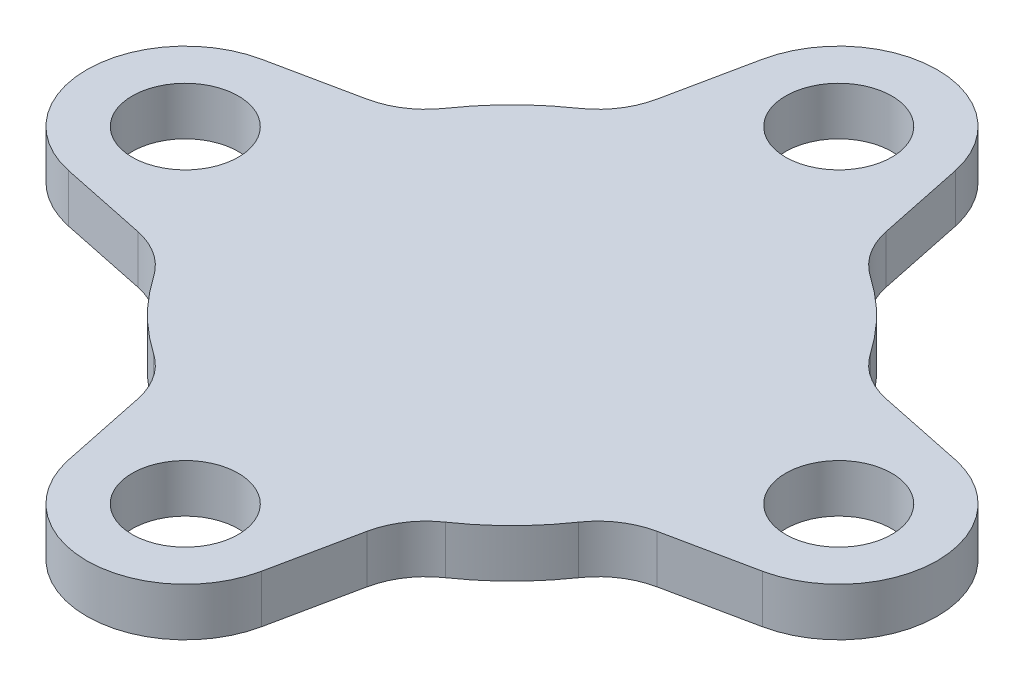
ISO-10303-21;
HEADER;
FILE_DESCRIPTION(('STEP AP214'),'2;1');
FILE_NAME('part.step','',(''),(''),'','','');
FILE_SCHEMA(('AUTOMOTIVE_DESIGN { 1 0 10303 214 1 1 1 1 }'));
ENDSEC;
DATA;
#1=APPLICATION_CONTEXT('core data for automotive mechanical design processes');
#2=APPLICATION_PROTOCOL_DEFINITION('international standard','automotive_design',2000,#1);
#3=PRODUCT_CONTEXT('',#1,'mechanical');
#4=PRODUCT('Part','Part','',(#3));
#5=PRODUCT_RELATED_PRODUCT_CATEGORY('part','',(#4));
#6=PRODUCT_DEFINITION_FORMATION('','',#4);
#7=PRODUCT_DEFINITION_CONTEXT('part definition',#1,'design');
#8=PRODUCT_DEFINITION('design','',#6,#7);
#9=PRODUCT_DEFINITION_SHAPE('','',#8);
#10=(LENGTH_UNIT() NAMED_UNIT(*) SI_UNIT(.MILLI.,.METRE.));
#11=(NAMED_UNIT(*) PLANE_ANGLE_UNIT() SI_UNIT($,.RADIAN.));
#12=(NAMED_UNIT(*) SI_UNIT($,.STERADIAN.) SOLID_ANGLE_UNIT());
#13=UNCERTAINTY_MEASURE_WITH_UNIT(LENGTH_MEASURE(1.E-05),#10,'distance_accuracy_value','');
#14=(GEOMETRIC_REPRESENTATION_CONTEXT(3) GLOBAL_UNCERTAINTY_ASSIGNED_CONTEXT((#13)) GLOBAL_UNIT_ASSIGNED_CONTEXT((#10,
#11,#12)) REPRESENTATION_CONTEXT('',''));
#15=CARTESIAN_POINT('',(0.,0.,0.));
#16=DIRECTION('',(0.,0.,1.));
#17=DIRECTION('',(1.,0.,0.));
#18=AXIS2_PLACEMENT_3D('',#15,#16,#17);
#19=CARTESIAN_POINT('',(12.4553051655854,3.175,-18.1346456605069));
#20=DIRECTION('',(0.,1.,0.));
#21=DIRECTION('',(0.,0.,1.));
#22=AXIS2_PLACEMENT_3D('',#19,#20,#21);
#23=PLANE('',#22);
#24=CARTESIAN_POINT('',(0.,3.175,21.54799995));
#25=DIRECTION('',(0.,1.,0.));
#26=DIRECTION('',(0.,0.,1.));
#27=AXIS2_PLACEMENT_3D('',#24,#25,#26);
#28=CIRCLE('',#27,3.5);
#29=CARTESIAN_POINT('',(0.,3.175,25.04799995));
#30=VERTEX_POINT('',#29);
#31=EDGE_CURVE('E260',#30,#30,#28,.T.);
#32=ORIENTED_EDGE('',*,*,#31,.F.);
#33=EDGE_LOOP('',(#32));
#34=FACE_BOUND('',#33,.T.);
#35=CARTESIAN_POINT('',(0.,3.175,-21.54799995));
#36=DIRECTION('',(0.,1.,0.));
#37=DIRECTION('',(0.,0.,1.));
#38=AXIS2_PLACEMENT_3D('',#35,#36,#37);
#39=CIRCLE('',#38,3.5);
#40=CARTESIAN_POINT('',(0.,3.175,-18.04799995));
#41=VERTEX_POINT('',#40);
#42=EDGE_CURVE('E261',#41,#41,#39,.T.);
#43=ORIENTED_EDGE('',*,*,#42,.F.);
#44=EDGE_LOOP('',(#43));
#45=FACE_BOUND('',#44,.T.);
#46=CARTESIAN_POINT('',(12.4553051655854,3.175,-18.1346456605069));
#47=DIRECTION('',(0.,-1.,0.));
#48=DIRECTION('',(0.,0.,1.));
#49=AXIS2_PLACEMENT_3D('',#46,#47,#48);
#50=CIRCLE('',#49,5.00000000000002);
#51=CARTESIAN_POINT('',(9.62455399158871,3.175,-14.013135283119));
#52=VERTEX_POINT('',#51);
#53=CARTESIAN_POINT('',(7.55994076097082,3.175,-17.1170959830796));
#54=VERTEX_POINT('',#53);
#55=EDGE_CURVE('E274',#52,#54,#50,.T.);
#56=ORIENTED_EDGE('',*,*,#55,.T.);
#57=DIRECTION('',(-0.20350993548547,0.,-0.979072880922917));
#58=VECTOR('',#57,1.);
#59=CARTESIAN_POINT('',(6.36397372599896,3.175,-22.8708145306556));
#60=LINE('',#59,#58);
#61=CARTESIAN_POINT('',(6.36397372599896,3.175,-22.8708145306556));
#62=VERTEX_POINT('',#61);
#63=EDGE_CURVE('E152',#54,#62,#60,.T.);
#64=ORIENTED_EDGE('',*,*,#63,.T.);
#65=CARTESIAN_POINT('',(0.,3.175,-21.54799995));
#66=DIRECTION('',(0.,1.,0.));
#67=DIRECTION('',(0.,0.,-1.));
#68=AXIS2_PLACEMENT_3D('',#65,#66,#67);
#69=CIRCLE('',#68,6.50000000000001);
#70=CARTESIAN_POINT('',(-6.36397372599897,3.175,-22.8708145306556));
#71=VERTEX_POINT('',#70);
#72=EDGE_CURVE('E280',#62,#71,#69,.T.);
#73=ORIENTED_EDGE('',*,*,#72,.T.);
#74=DIRECTION('',(-0.203509935485466,0.,0.979072880922918));
#75=VECTOR('',#74,1.);
#76=CARTESIAN_POINT('',(-7.55994076097081,3.175,-17.1170959830796));
#77=LINE('',#76,#75);
#78=CARTESIAN_POINT('',(-7.55994076097081,3.175,-17.1170959830796));
#79=VERTEX_POINT('',#78);
#80=EDGE_CURVE('E284',#71,#79,#77,.T.);
#81=ORIENTED_EDGE('',*,*,#80,.T.);
#82=CARTESIAN_POINT('',(-12.4553051655854,3.175,-18.1346456605069));
#83=DIRECTION('',(0.,-1.,0.));
#84=DIRECTION('',(0.,0.,-1.));
#85=AXIS2_PLACEMENT_3D('',#82,#83,#84);
#86=CIRCLE('',#85,5.00000000000001);
#87=CARTESIAN_POINT('',(-9.62455399158873,3.175,-14.013135283119));
#88=VERTEX_POINT('',#87);
#89=EDGE_CURVE('E292',#79,#88,#86,.T.);
#90=ORIENTED_EDGE('',*,*,#89,.T.);
#91=CARTESIAN_POINT('',(0.,3.175,0.));
#92=DIRECTION('',(0.,1.,0.));
#93=DIRECTION('',(0.,0.,1.));
#94=AXIS2_PLACEMENT_3D('',#91,#92,#93);
#95=CIRCLE('',#94,17.);
#96=CARTESIAN_POINT('',(-14.013135283119,3.175,-9.62455399158871));
#97=VERTEX_POINT('',#96);
#98=EDGE_CURVE('E295',#88,#97,#95,.T.);
#99=ORIENTED_EDGE('',*,*,#98,.T.);
#100=CARTESIAN_POINT('',(-18.1346456605069,3.175,-12.4553051655854));
#101=DIRECTION('',(0.,-1.,0.));
#102=DIRECTION('',(0.,0.,1.));
#103=AXIS2_PLACEMENT_3D('',#100,#101,#102);
#104=CIRCLE('',#103,5.00000000000002);
#105=CARTESIAN_POINT('',(-17.1170959830796,3.175,-7.5599407609708));
#106=VERTEX_POINT('',#105);
#107=EDGE_CURVE('E299',#97,#106,#104,.T.);
#108=ORIENTED_EDGE('',*,*,#107,.T.);
#109=DIRECTION('',(-0.979072880922917,0.,0.203509935485469));
#110=VECTOR('',#109,1.);
#111=CARTESIAN_POINT('',(-22.8708145306556,3.175,-6.36397372599896));
#112=LINE('',#111,#110);
#113=CARTESIAN_POINT('',(-22.8708145306556,3.175,-6.36397372599896));
#114=VERTEX_POINT('',#113);
#115=EDGE_CURVE('E303',#106,#114,#112,.T.);
#116=ORIENTED_EDGE('',*,*,#115,.T.);
#117=CARTESIAN_POINT('',(-21.54799995,3.175,0.));
#118=DIRECTION('',(0.,1.,0.));
#119=DIRECTION('',(0.,0.,-1.));
#120=AXIS2_PLACEMENT_3D('',#117,#118,#119);
#121=CIRCLE('',#120,6.50000000000001);
#122=CARTESIAN_POINT('',(-22.8708145306556,3.175,6.36397372599897));
#123=VERTEX_POINT('',#122);
#124=EDGE_CURVE('E311',#114,#123,#121,.T.);
#125=ORIENTED_EDGE('',*,*,#124,.T.);
#126=DIRECTION('',(0.979072880922918,0.,0.203509935485466));
#127=VECTOR('',#126,1.);
#128=CARTESIAN_POINT('',(-17.1170959830796,3.175,7.55994076097082));
#129=LINE('',#128,#127);
#130=CARTESIAN_POINT('',(-17.1170959830796,3.175,7.55994076097082));
#131=VERTEX_POINT('',#130);
#132=EDGE_CURVE('E314',#123,#131,#129,.T.);
#133=ORIENTED_EDGE('',*,*,#132,.T.);
#134=CARTESIAN_POINT('',(-18.1346456605069,3.175,12.4553051655854));
#135=DIRECTION('',(0.,-1.,0.));
#136=DIRECTION('',(0.,0.,-1.));
#137=AXIS2_PLACEMENT_3D('',#134,#135,#136);
#138=CIRCLE('',#137,5.00000000000001);
#139=CARTESIAN_POINT('',(-14.013135283119,3.175,9.62455399158873));
#140=VERTEX_POINT('',#139);
#141=EDGE_CURVE('E318',#131,#140,#138,.T.);
#142=ORIENTED_EDGE('',*,*,#141,.T.);
#143=CARTESIAN_POINT('',(0.,3.175,0.));
#144=DIRECTION('',(0.,1.,0.));
#145=DIRECTION('',(0.,0.,1.));
#146=AXIS2_PLACEMENT_3D('',#143,#144,#145);
#147=CIRCLE('',#146,17.);
#148=CARTESIAN_POINT('',(-9.62455399158871,3.175,14.013135283119));
#149=VERTEX_POINT('',#148);
#150=EDGE_CURVE('E322',#140,#149,#147,.T.);
#151=ORIENTED_EDGE('',*,*,#150,.T.);
#152=CARTESIAN_POINT('',(-12.4553051655854,3.175,18.1346456605069));
#153=DIRECTION('',(0.,-1.,0.));
#154=DIRECTION('',(0.,0.,1.));
#155=AXIS2_PLACEMENT_3D('',#152,#153,#154);
#156=CIRCLE('',#155,5.00000000000002);
#157=CARTESIAN_POINT('',(-7.5599407609708,3.175,17.1170959830796));
#158=VERTEX_POINT('',#157);
#159=EDGE_CURVE('E330',#149,#158,#156,.T.);
#160=ORIENTED_EDGE('',*,*,#159,.T.);
#161=DIRECTION('',(0.20350993548547,0.,0.979072880922917));
#162=VECTOR('',#161,1.);
#163=CARTESIAN_POINT('',(-6.36397372599896,3.175,22.8708145306556));
#164=LINE('',#163,#162);
#165=CARTESIAN_POINT('',(-6.36397372599896,3.175,22.8708145306556));
#166=VERTEX_POINT('',#165);
#167=EDGE_CURVE('E333',#158,#166,#164,.T.);
#168=ORIENTED_EDGE('',*,*,#167,.T.);
#169=CARTESIAN_POINT('',(0.,3.175,21.54799995));
#170=DIRECTION('',(0.,1.,0.));
#171=DIRECTION('',(0.,0.,-1.));
#172=AXIS2_PLACEMENT_3D('',#169,#170,#171);
#173=CIRCLE('',#172,6.50000000000001);
#174=CARTESIAN_POINT('',(6.36397372599897,3.175,22.8708145306556));
#175=VERTEX_POINT('',#174);
#176=EDGE_CURVE('E337',#166,#175,#173,.T.);
#177=ORIENTED_EDGE('',*,*,#176,.T.);
#178=DIRECTION('',(0.203509935485466,0.,-0.979072880922918));
#179=VECTOR('',#178,1.);
#180=CARTESIAN_POINT('',(7.55994076097082,3.175,17.1170959830796));
#181=LINE('',#180,#179);
#182=CARTESIAN_POINT('',(7.55994076097082,3.175,17.1170959830796));
#183=VERTEX_POINT('',#182);
#184=EDGE_CURVE('E341',#175,#183,#181,.T.);
#185=ORIENTED_EDGE('',*,*,#184,.T.);
#186=CARTESIAN_POINT('',(12.4553051655854,3.175,18.1346456605069));
#187=DIRECTION('',(0.,-1.,0.));
#188=DIRECTION('',(0.,0.,-1.));
#189=AXIS2_PLACEMENT_3D('',#186,#187,#188);
#190=CIRCLE('',#189,5.00000000000001);
#191=CARTESIAN_POINT('',(9.62455399158873,3.175,14.013135283119));
#192=VERTEX_POINT('',#191);
#193=EDGE_CURVE('E349',#183,#192,#190,.T.);
#194=ORIENTED_EDGE('',*,*,#193,.T.);
#195=CARTESIAN_POINT('',(0.,3.175,0.));
#196=DIRECTION('',(0.,1.,0.));
#197=DIRECTION('',(0.,0.,1.));
#198=AXIS2_PLACEMENT_3D('',#195,#196,#197);
#199=CIRCLE('',#198,17.);
#200=CARTESIAN_POINT('',(14.013135283119,3.175,9.62455399158871));
#201=VERTEX_POINT('',#200);
#202=EDGE_CURVE('E352',#192,#201,#199,.T.);
#203=ORIENTED_EDGE('',*,*,#202,.T.);
#204=CARTESIAN_POINT('',(18.1346456605069,3.175,12.4553051655854));
#205=DIRECTION('',(0.,-1.,0.));
#206=DIRECTION('',(0.,0.,1.));
#207=AXIS2_PLACEMENT_3D('',#204,#205,#206);
#208=CIRCLE('',#207,5.00000000000002);
#209=CARTESIAN_POINT('',(17.1170959830796,3.175,7.5599407609708));
#210=VERTEX_POINT('',#209);
#211=EDGE_CURVE('E356',#201,#210,#208,.T.);
#212=ORIENTED_EDGE('',*,*,#211,.T.);
#213=DIRECTION('',(0.979072880922917,0.,-0.203509935485469));
#214=VECTOR('',#213,1.);
#215=CARTESIAN_POINT('',(22.8708145306556,3.175,6.36397372599896));
#216=LINE('',#215,#214);
#217=CARTESIAN_POINT('',(22.8708145306556,3.175,6.36397372599896));
#218=VERTEX_POINT('',#217);
#219=EDGE_CURVE('E360',#210,#218,#216,.T.);
#220=ORIENTED_EDGE('',*,*,#219,.T.);
#221=CARTESIAN_POINT('',(21.54799995,3.175,0.));
#222=DIRECTION('',(0.,1.,0.));
#223=DIRECTION('',(0.,0.,-1.));
#224=AXIS2_PLACEMENT_3D('',#221,#222,#223);
#225=CIRCLE('',#224,6.50000000000001);
#226=CARTESIAN_POINT('',(22.8708145306556,3.175,-6.36397372599897));
#227=VERTEX_POINT('',#226);
#228=EDGE_CURVE('E219',#218,#227,#225,.T.);
#229=ORIENTED_EDGE('',*,*,#228,.T.);
#230=DIRECTION('',(-0.979072880922918,0.,-0.203509935485466));
#231=VECTOR('',#230,1.);
#232=CARTESIAN_POINT('',(17.1170959830796,3.175,-7.55994076097081));
#233=LINE('',#232,#231);
#234=CARTESIAN_POINT('',(17.1170959830796,3.175,-7.55994076097081));
#235=VERTEX_POINT('',#234);
#236=EDGE_CURVE('E213',#227,#235,#233,.T.);
#237=ORIENTED_EDGE('',*,*,#236,.T.);
#238=CARTESIAN_POINT('',(18.1346456605069,3.175,-12.4553051655854));
#239=DIRECTION('',(0.,-1.,0.));
#240=DIRECTION('',(0.,0.,-1.));
#241=AXIS2_PLACEMENT_3D('',#238,#239,#240);
#242=CIRCLE('',#241,5.00000000000001);
#243=CARTESIAN_POINT('',(14.013135283119,3.175,-9.62455399158873));
#244=VERTEX_POINT('',#243);
#245=EDGE_CURVE('E217',#235,#244,#242,.T.);
#246=ORIENTED_EDGE('',*,*,#245,.T.);
#247=CARTESIAN_POINT('',(0.,3.175,0.));
#248=DIRECTION('',(0.,1.,0.));
#249=DIRECTION('',(0.,0.,1.));
#250=AXIS2_PLACEMENT_3D('',#247,#248,#249);
#251=CIRCLE('',#250,17.);
#252=EDGE_CURVE('E61',#244,#52,#251,.T.);
#253=ORIENTED_EDGE('',*,*,#252,.T.);
#254=EDGE_LOOP('',(#56,#64,#73,#81,#90,#99,#108,#116,#125,#133,#142,#151,#160,#168,#177,#185,
#194,#203,#212,#220,#229,#237,#246,#253));
#255=FACE_BOUND('',#254,.T.);
#256=CARTESIAN_POINT('',(21.54799995,3.175,0.));
#257=DIRECTION('',(0.,1.,0.));
#258=DIRECTION('',(0.,0.,1.));
#259=AXIS2_PLACEMENT_3D('',#256,#257,#258);
#260=CIRCLE('',#259,3.5);
#261=CARTESIAN_POINT('',(21.54799995,3.175,3.5));
#262=VERTEX_POINT('',#261);
#263=EDGE_CURVE('E248',#262,#262,#260,.T.);
#264=ORIENTED_EDGE('',*,*,#263,.F.);
#265=EDGE_LOOP('',(#264));
#266=FACE_BOUND('',#265,.T.);
#267=CARTESIAN_POINT('',(-21.54799995,3.175,0.));
#268=DIRECTION('',(0.,1.,0.));
#269=DIRECTION('',(0.,0.,1.));
#270=AXIS2_PLACEMENT_3D('',#267,#268,#269);
#271=CIRCLE('',#270,3.5);
#272=CARTESIAN_POINT('',(-21.54799995,3.175,3.5));
#273=VERTEX_POINT('',#272);
#274=EDGE_CURVE('E826',#273,#273,#271,.T.);
#275=ORIENTED_EDGE('',*,*,#274,.F.);
#276=EDGE_LOOP('',(#275));
#277=FACE_BOUND('',#276,.T.);
#278=ADVANCED_FACE('F44',(#34,#45,#255,#266,#277),#23,.T.);
#279=CARTESIAN_POINT('',(12.4553051655854,0.,-18.1346456605069));
#280=DIRECTION('',(0.,1.,0.));
#281=DIRECTION('',(0.,0.,1.));
#282=AXIS2_PLACEMENT_3D('',#279,#280,#281);
#283=PLANE('',#282);
#284=CARTESIAN_POINT('',(12.4553051655854,0.,-18.1346456605069));
#285=DIRECTION('',(0.,-1.,0.));
#286=DIRECTION('',(0.,0.,1.));
#287=AXIS2_PLACEMENT_3D('',#284,#285,#286);
#288=CIRCLE('',#287,5.00000000000002);
#289=CARTESIAN_POINT('',(9.62455399158871,0.,-14.013135283119));
#290=VERTEX_POINT('',#289);
#291=CARTESIAN_POINT('',(7.55994076097082,0.,-17.1170959830796));
#292=VERTEX_POINT('',#291);
#293=EDGE_CURVE('E266',#290,#292,#288,.T.);
#294=ORIENTED_EDGE('',*,*,#293,.F.);
#295=CARTESIAN_POINT('',(0.,0.,0.));
#296=DIRECTION('',(0.,1.,0.));
#297=DIRECTION('',(0.,0.,1.));
#298=AXIS2_PLACEMENT_3D('',#295,#296,#297);
#299=CIRCLE('',#298,17.);
#300=CARTESIAN_POINT('',(14.013135283119,0.,-9.62455399158873));
#301=VERTEX_POINT('',#300);
#302=EDGE_CURVE('E144',#301,#290,#299,.T.);
#303=ORIENTED_EDGE('',*,*,#302,.F.);
#304=CARTESIAN_POINT('',(18.1346456605069,0.,-12.4553051655854));
#305=DIRECTION('',(0.,-1.,0.));
#306=DIRECTION('',(0.,0.,-1.));
#307=AXIS2_PLACEMENT_3D('',#304,#305,#306);
#308=CIRCLE('',#307,5.00000000000001);
#309=CARTESIAN_POINT('',(17.1170959830796,0.,-7.55994076097081));
#310=VERTEX_POINT('',#309);
#311=EDGE_CURVE('E138',#310,#301,#308,.T.);
#312=ORIENTED_EDGE('',*,*,#311,.F.);
#313=DIRECTION('',(-0.979072880922918,0.,-0.203509935485466));
#314=VECTOR('',#313,1.);
#315=CARTESIAN_POINT('',(17.1170959830796,0.,-7.55994076097081));
#316=LINE('',#315,#314);
#317=CARTESIAN_POINT('',(22.8708145306556,0.,-6.36397372599897));
#318=VERTEX_POINT('',#317);
#319=EDGE_CURVE('E228',#318,#310,#316,.T.);
#320=ORIENTED_EDGE('',*,*,#319,.F.);
#321=CARTESIAN_POINT('',(21.54799995,0.,0.));
#322=DIRECTION('',(0.,1.,0.));
#323=DIRECTION('',(0.,0.,-1.));
#324=AXIS2_PLACEMENT_3D('',#321,#322,#323);
#325=CIRCLE('',#324,6.50000000000001);
#326=CARTESIAN_POINT('',(22.8708145306556,0.,6.36397372599896));
#327=VERTEX_POINT('',#326);
#328=EDGE_CURVE('E382',#327,#318,#325,.T.);
#329=ORIENTED_EDGE('',*,*,#328,.F.);
#330=DIRECTION('',(0.979072880922917,0.,-0.203509935485469));
#331=VECTOR('',#330,1.);
#332=CARTESIAN_POINT('',(22.8708145306556,0.,6.36397372599896));
#333=LINE('',#332,#331);
#334=CARTESIAN_POINT('',(17.1170959830796,0.,7.5599407609708));
#335=VERTEX_POINT('',#334);
#336=EDGE_CURVE('E376',#335,#327,#333,.T.);
#337=ORIENTED_EDGE('',*,*,#336,.F.);
#338=CARTESIAN_POINT('',(18.1346456605069,0.,12.4553051655854));
#339=DIRECTION('',(0.,-1.,0.));
#340=DIRECTION('',(0.,0.,1.));
#341=AXIS2_PLACEMENT_3D('',#338,#339,#340);
#342=CIRCLE('',#341,5.00000000000002);
#343=CARTESIAN_POINT('',(14.013135283119,0.,9.62455399158871));
#344=VERTEX_POINT('',#343);
#345=EDGE_CURVE('E481',#344,#335,#342,.T.);
#346=ORIENTED_EDGE('',*,*,#345,.F.);
#347=CARTESIAN_POINT('',(0.,0.,0.));
#348=DIRECTION('',(0.,1.,0.));
#349=DIRECTION('',(0.,0.,1.));
#350=AXIS2_PLACEMENT_3D('',#347,#348,#349);
#351=CIRCLE('',#350,17.);
#352=CARTESIAN_POINT('',(9.62455399158873,0.,14.013135283119));
#353=VERTEX_POINT('',#352);
#354=EDGE_CURVE('E479',#353,#344,#351,.T.);
#355=ORIENTED_EDGE('',*,*,#354,.F.);
#356=CARTESIAN_POINT('',(12.4553051655854,0.,18.1346456605069));
#357=DIRECTION('',(0.,-1.,0.));
#358=DIRECTION('',(0.,0.,-1.));
#359=AXIS2_PLACEMENT_3D('',#356,#357,#358);
#360=CIRCLE('',#359,5.00000000000001);
#361=CARTESIAN_POINT('',(7.55994076097082,0.,17.1170959830796));
#362=VERTEX_POINT('',#361);
#363=EDGE_CURVE('E477',#362,#353,#360,.T.);
#364=ORIENTED_EDGE('',*,*,#363,.F.);
#365=DIRECTION('',(0.203509935485466,0.,-0.979072880922918));
#366=VECTOR('',#365,1.);
#367=CARTESIAN_POINT('',(7.55994076097082,0.,17.1170959830796));
#368=LINE('',#367,#366);
#369=CARTESIAN_POINT('',(6.36397372599897,0.,22.8708145306556));
#370=VERTEX_POINT('',#369);
#371=EDGE_CURVE('E475',#370,#362,#368,.T.);
#372=ORIENTED_EDGE('',*,*,#371,.F.);
#373=CARTESIAN_POINT('',(0.,0.,21.54799995));
#374=DIRECTION('',(0.,1.,0.));
#375=DIRECTION('',(0.,0.,-1.));
#376=AXIS2_PLACEMENT_3D('',#373,#374,#375);
#377=CIRCLE('',#376,6.50000000000001);
#378=CARTESIAN_POINT('',(-6.36397372599896,0.,22.8708145306556));
#379=VERTEX_POINT('',#378);
#380=EDGE_CURVE('E473',#379,#370,#377,.T.);
#381=ORIENTED_EDGE('',*,*,#380,.F.);
#382=DIRECTION('',(0.20350993548547,0.,0.979072880922917));
#383=VECTOR('',#382,1.);
#384=CARTESIAN_POINT('',(-6.36397372599896,0.,22.8708145306556));
#385=LINE('',#384,#383);
#386=CARTESIAN_POINT('',(-7.5599407609708,0.,17.1170959830796));
#387=VERTEX_POINT('',#386);
#388=EDGE_CURVE('E471',#387,#379,#385,.T.);
#389=ORIENTED_EDGE('',*,*,#388,.F.);
#390=CARTESIAN_POINT('',(-12.4553051655854,0.,18.1346456605069));
#391=DIRECTION('',(0.,-1.,0.));
#392=DIRECTION('',(0.,0.,1.));
#393=AXIS2_PLACEMENT_3D('',#390,#391,#392);
#394=CIRCLE('',#393,5.00000000000002);
#395=CARTESIAN_POINT('',(-9.62455399158871,0.,14.013135283119));
#396=VERTEX_POINT('',#395);
#397=EDGE_CURVE('E469',#396,#387,#394,.T.);
#398=ORIENTED_EDGE('',*,*,#397,.F.);
#399=CARTESIAN_POINT('',(0.,0.,0.));
#400=DIRECTION('',(0.,1.,0.));
#401=DIRECTION('',(0.,0.,1.));
#402=AXIS2_PLACEMENT_3D('',#399,#400,#401);
#403=CIRCLE('',#402,17.);
#404=CARTESIAN_POINT('',(-14.013135283119,0.,9.62455399158873));
#405=VERTEX_POINT('',#404);
#406=EDGE_CURVE('E467',#405,#396,#403,.T.);
#407=ORIENTED_EDGE('',*,*,#406,.F.);
#408=CARTESIAN_POINT('',(-18.1346456605069,0.,12.4553051655854));
#409=DIRECTION('',(0.,-1.,0.));
#410=DIRECTION('',(0.,0.,-1.));
#411=AXIS2_PLACEMENT_3D('',#408,#409,#410);
#412=CIRCLE('',#411,5.00000000000001);
#413=CARTESIAN_POINT('',(-17.1170959830796,0.,7.55994076097082));
#414=VERTEX_POINT('',#413);
#415=EDGE_CURVE('E465',#414,#405,#412,.T.);
#416=ORIENTED_EDGE('',*,*,#415,.F.);
#417=DIRECTION('',(0.979072880922918,0.,0.203509935485466));
#418=VECTOR('',#417,1.);
#419=CARTESIAN_POINT('',(-17.1170959830796,0.,7.55994076097082));
#420=LINE('',#419,#418);
#421=CARTESIAN_POINT('',(-22.8708145306556,0.,6.36397372599897));
#422=VERTEX_POINT('',#421);
#423=EDGE_CURVE('E463',#422,#414,#420,.T.);
#424=ORIENTED_EDGE('',*,*,#423,.F.);
#425=CARTESIAN_POINT('',(-21.54799995,0.,0.));
#426=DIRECTION('',(0.,1.,0.));
#427=DIRECTION('',(0.,0.,-1.));
#428=AXIS2_PLACEMENT_3D('',#425,#426,#427);
#429=CIRCLE('',#428,6.50000000000001);
#430=CARTESIAN_POINT('',(-22.8708145306556,0.,-6.36397372599896));
#431=VERTEX_POINT('',#430);
#432=EDGE_CURVE('E461',#431,#422,#429,.T.);
#433=ORIENTED_EDGE('',*,*,#432,.F.);
#434=DIRECTION('',(-0.979072880922917,0.,0.203509935485469));
#435=VECTOR('',#434,1.);
#436=CARTESIAN_POINT('',(-22.8708145306556,0.,-6.36397372599896));
#437=LINE('',#436,#435);
#438=CARTESIAN_POINT('',(-17.1170959830796,0.,-7.5599407609708));
#439=VERTEX_POINT('',#438);
#440=EDGE_CURVE('E459',#439,#431,#437,.T.);
#441=ORIENTED_EDGE('',*,*,#440,.F.);
#442=CARTESIAN_POINT('',(-18.1346456605069,0.,-12.4553051655854));
#443=DIRECTION('',(0.,-1.,0.));
#444=DIRECTION('',(0.,0.,1.));
#445=AXIS2_PLACEMENT_3D('',#442,#443,#444);
#446=CIRCLE('',#445,5.00000000000002);
#447=CARTESIAN_POINT('',(-14.013135283119,0.,-9.62455399158871));
#448=VERTEX_POINT('',#447);
#449=EDGE_CURVE('E457',#448,#439,#446,.T.);
#450=ORIENTED_EDGE('',*,*,#449,.F.);
#451=CARTESIAN_POINT('',(0.,0.,0.));
#452=DIRECTION('',(0.,1.,0.));
#453=DIRECTION('',(0.,0.,1.));
#454=AXIS2_PLACEMENT_3D('',#451,#452,#453);
#455=CIRCLE('',#454,17.);
#456=CARTESIAN_POINT('',(-9.62455399158873,0.,-14.013135283119));
#457=VERTEX_POINT('',#456);
#458=EDGE_CURVE('E455',#457,#448,#455,.T.);
#459=ORIENTED_EDGE('',*,*,#458,.F.);
#460=CARTESIAN_POINT('',(-12.4553051655854,0.,-18.1346456605069));
#461=DIRECTION('',(0.,-1.,0.));
#462=DIRECTION('',(0.,0.,-1.));
#463=AXIS2_PLACEMENT_3D('',#460,#461,#462);
#464=CIRCLE('',#463,5.00000000000001);
#465=CARTESIAN_POINT('',(-7.55994076097081,0.,-17.1170959830796));
#466=VERTEX_POINT('',#465);
#467=EDGE_CURVE('E450',#466,#457,#464,.T.);
#468=ORIENTED_EDGE('',*,*,#467,.F.);
#469=DIRECTION('',(-0.203509935485466,0.,0.979072880922918));
#470=VECTOR('',#469,1.);
#471=CARTESIAN_POINT('',(-7.55994076097081,0.,-17.1170959830796));
#472=LINE('',#471,#470);
#473=CARTESIAN_POINT('',(-6.36397372599897,0.,-22.8708145306556));
#474=VERTEX_POINT('',#473);
#475=EDGE_CURVE('E448',#474,#466,#472,.T.);
#476=ORIENTED_EDGE('',*,*,#475,.F.);
#477=CARTESIAN_POINT('',(0.,0.,-21.54799995));
#478=DIRECTION('',(0.,1.,0.));
#479=DIRECTION('',(0.,0.,-1.));
#480=AXIS2_PLACEMENT_3D('',#477,#478,#479);
#481=CIRCLE('',#480,6.50000000000001);
#482=CARTESIAN_POINT('',(6.36397372599896,0.,-22.8708145306556));
#483=VERTEX_POINT('',#482);
#484=EDGE_CURVE('E440',#483,#474,#481,.T.);
#485=ORIENTED_EDGE('',*,*,#484,.F.);
#486=DIRECTION('',(-0.20350993548547,0.,-0.979072880922917));
#487=VECTOR('',#486,1.);
#488=CARTESIAN_POINT('',(6.36397372599896,0.,-22.8708145306556));
#489=LINE('',#488,#487);
#490=EDGE_CURVE('E446',#292,#483,#489,.T.);
#491=ORIENTED_EDGE('',*,*,#490,.F.);
#492=EDGE_LOOP('',(#294,#303,#312,#320,#329,#337,#346,#355,#364,#372,#381,#389,#398,#407,#416,
#424,#433,#441,#450,#459,#468,#476,#485,#491));
#493=FACE_BOUND('',#492,.T.);
#494=CARTESIAN_POINT('',(0.,0.,-21.54799995));
#495=DIRECTION('',(0.,1.,0.));
#496=DIRECTION('',(0.,0.,1.));
#497=AXIS2_PLACEMENT_3D('',#494,#495,#496);
#498=CIRCLE('',#497,3.5);
#499=CARTESIAN_POINT('',(0.,0.,-18.04799995));
#500=VERTEX_POINT('',#499);
#501=EDGE_CURVE('E254',#500,#500,#498,.T.);
#502=ORIENTED_EDGE('',*,*,#501,.T.);
#503=EDGE_LOOP('',(#502));
#504=FACE_BOUND('',#503,.T.);
#505=CARTESIAN_POINT('',(21.54799995,0.,0.));
#506=DIRECTION('',(0.,1.,0.));
#507=DIRECTION('',(0.,0.,1.));
#508=AXIS2_PLACEMENT_3D('',#505,#506,#507);
#509=CIRCLE('',#508,3.5);
#510=CARTESIAN_POINT('',(21.54799995,0.,3.5));
#511=VERTEX_POINT('',#510);
#512=EDGE_CURVE('E255',#511,#511,#509,.T.);
#513=ORIENTED_EDGE('',*,*,#512,.T.);
#514=EDGE_LOOP('',(#513));
#515=FACE_BOUND('',#514,.T.);
#516=CARTESIAN_POINT('',(0.,0.,21.54799995));
#517=DIRECTION('',(0.,1.,0.));
#518=DIRECTION('',(0.,0.,1.));
#519=AXIS2_PLACEMENT_3D('',#516,#517,#518);
#520=CIRCLE('',#519,3.5);
#521=CARTESIAN_POINT('',(0.,0.,25.04799995));
#522=VERTEX_POINT('',#521);
#523=EDGE_CURVE('E256',#522,#522,#520,.T.);
#524=ORIENTED_EDGE('',*,*,#523,.T.);
#525=EDGE_LOOP('',(#524));
#526=FACE_BOUND('',#525,.T.);
#527=CARTESIAN_POINT('',(-21.54799995,0.,0.));
#528=DIRECTION('',(0.,1.,0.));
#529=DIRECTION('',(0.,0.,1.));
#530=AXIS2_PLACEMENT_3D('',#527,#528,#529);
#531=CIRCLE('',#530,3.5);
#532=CARTESIAN_POINT('',(-21.54799995,0.,3.5));
#533=VERTEX_POINT('',#532);
#534=EDGE_CURVE('E829',#533,#533,#531,.T.);
#535=ORIENTED_EDGE('',*,*,#534,.T.);
#536=EDGE_LOOP('',(#535));
#537=FACE_BOUND('',#536,.T.);
#538=ADVANCED_FACE('F444',(#493,#504,#515,#526,#537),#283,.F.);
#539=CARTESIAN_POINT('',(12.4553051655854,3.175,-18.1346456605069));
#540=DIRECTION('',(0.,-1.,0.));
#541=DIRECTION('',(0.,0.,-1.));
#542=AXIS2_PLACEMENT_3D('',#539,#540,#541);
#543=CYLINDRICAL_SURFACE('',#542,5.00000000000002);
#544=ORIENTED_EDGE('',*,*,#293,.T.);
#545=DIRECTION('',(0.,-1.,0.));
#546=VECTOR('',#545,1.);
#547=CARTESIAN_POINT('',(7.55994076097082,3.175,-17.1170959830796));
#548=LINE('',#547,#546);
#549=EDGE_CURVE('E12',#54,#292,#548,.T.);
#550=ORIENTED_EDGE('',*,*,#549,.F.);
#551=ORIENTED_EDGE('',*,*,#55,.F.);
#552=DIRECTION('',(0.,-1.,0.));
#553=VECTOR('',#552,1.);
#554=CARTESIAN_POINT('',(9.62455399158871,3.175,-14.013135283119));
#555=LINE('',#554,#553);
#556=EDGE_CURVE('E236',#52,#290,#555,.T.);
#557=ORIENTED_EDGE('',*,*,#556,.T.);
#558=EDGE_LOOP('',(#544,#550,#551,#557));
#559=FACE_BOUND('',#558,.T.);
#560=ADVANCED_FACE('F46',(#559),#543,.F.);
#561=CARTESIAN_POINT('',(6.36397372599896,3.175,-22.8708145306556));
#562=DIRECTION('',(-0.979072880922917,0.,0.20350993548547));
#563=DIRECTION('',(0.20350993548547,0.,0.979072880922917));
#564=AXIS2_PLACEMENT_3D('',#561,#562,#563);
#565=PLANE('',#564);
#566=ORIENTED_EDGE('',*,*,#490,.T.);
#567=DIRECTION('',(0.,-1.,0.));
#568=VECTOR('',#567,1.);
#569=CARTESIAN_POINT('',(6.36397372599896,3.175,-22.8708145306556));
#570=LINE('',#569,#568);
#571=EDGE_CURVE('E53',#62,#483,#570,.T.);
#572=ORIENTED_EDGE('',*,*,#571,.F.);
#573=ORIENTED_EDGE('',*,*,#63,.F.);
#574=ORIENTED_EDGE('',*,*,#549,.T.);
#575=EDGE_LOOP('',(#566,#572,#573,#574));
#576=FACE_BOUND('',#575,.T.);
#577=ADVANCED_FACE('F794',(#576),#565,.F.);
#578=CARTESIAN_POINT('',(0.,3.175,-21.54799995));
#579=DIRECTION('',(0.,-1.,0.));
#580=DIRECTION('',(0.,0.,-1.));
#581=AXIS2_PLACEMENT_3D('',#578,#579,#580);
#582=CYLINDRICAL_SURFACE('',#581,6.50000000000001);
#583=ORIENTED_EDGE('',*,*,#484,.T.);
#584=DIRECTION('',(0.,-1.,0.));
#585=VECTOR('',#584,1.);
#586=CARTESIAN_POINT('',(-6.36397372599897,3.175,-22.8708145306556));
#587=LINE('',#586,#585);
#588=EDGE_CURVE('E432',#71,#474,#587,.T.);
#589=ORIENTED_EDGE('',*,*,#588,.F.);
#590=ORIENTED_EDGE('',*,*,#72,.F.);
#591=ORIENTED_EDGE('',*,*,#571,.T.);
#592=EDGE_LOOP('',(#583,#589,#590,#591));
#593=FACE_BOUND('',#592,.T.);
#594=ADVANCED_FACE('F438',(#593),#582,.T.);
#595=CARTESIAN_POINT('',(-7.55994076097081,3.175,-17.1170959830796));
#596=DIRECTION('',(0.979072880922918,0.,0.203509935485466));
#597=DIRECTION('',(0.203509935485466,0.,-0.979072880922918));
#598=AXIS2_PLACEMENT_3D('',#595,#596,#597);
#599=PLANE('',#598);
#600=ORIENTED_EDGE('',*,*,#475,.T.);
#601=DIRECTION('',(0.,-1.,0.));
#602=VECTOR('',#601,1.);
#603=CARTESIAN_POINT('',(-7.55994076097081,3.175,-17.1170959830796));
#604=LINE('',#603,#602);
#605=EDGE_CURVE('E429',#79,#466,#604,.T.);
#606=ORIENTED_EDGE('',*,*,#605,.F.);
#607=ORIENTED_EDGE('',*,*,#80,.F.);
#608=ORIENTED_EDGE('',*,*,#588,.T.);
#609=EDGE_LOOP('',(#600,#606,#607,#608));
#610=FACE_BOUND('',#609,.T.);
#611=ADVANCED_FACE('F496',(#610),#599,.F.);
#612=CARTESIAN_POINT('',(-12.4553051655854,3.175,-18.1346456605069));
#613=DIRECTION('',(0.,-1.,0.));
#614=DIRECTION('',(0.,0.,-1.));
#615=AXIS2_PLACEMENT_3D('',#612,#613,#614);
#616=CYLINDRICAL_SURFACE('',#615,5.00000000000001);
#617=ORIENTED_EDGE('',*,*,#467,.T.);
#618=DIRECTION('',(0.,-1.,0.));
#619=VECTOR('',#618,1.);
#620=CARTESIAN_POINT('',(-9.62455399158873,3.175,-14.013135283119));
#621=LINE('',#620,#619);
#622=EDGE_CURVE('E426',#88,#457,#621,.T.);
#623=ORIENTED_EDGE('',*,*,#622,.F.);
#624=ORIENTED_EDGE('',*,*,#89,.F.);
#625=ORIENTED_EDGE('',*,*,#605,.T.);
#626=EDGE_LOOP('',(#617,#623,#624,#625));
#627=FACE_BOUND('',#626,.T.);
#628=ADVANCED_FACE('F572',(#627),#616,.F.);
#629=CARTESIAN_POINT('',(0.,3.175,0.));
#630=DIRECTION('',(0.,-1.,0.));
#631=DIRECTION('',(0.,0.,-1.));
#632=AXIS2_PLACEMENT_3D('',#629,#630,#631);
#633=CYLINDRICAL_SURFACE('',#632,17.);
#634=ORIENTED_EDGE('',*,*,#458,.T.);
#635=DIRECTION('',(0.,-1.,0.));
#636=VECTOR('',#635,1.);
#637=CARTESIAN_POINT('',(-14.013135283119,3.175,-9.62455399158871));
#638=LINE('',#637,#636);
#639=EDGE_CURVE('E423',#97,#448,#638,.T.);
#640=ORIENTED_EDGE('',*,*,#639,.F.);
#641=ORIENTED_EDGE('',*,*,#98,.F.);
#642=ORIENTED_EDGE('',*,*,#622,.T.);
#643=EDGE_LOOP('',(#634,#640,#641,#642));
#644=FACE_BOUND('',#643,.T.);
#645=ADVANCED_FACE('F568',(#644),#633,.T.);
#646=CARTESIAN_POINT('',(-18.1346456605069,3.175,-12.4553051655854));
#647=DIRECTION('',(0.,-1.,0.));
#648=DIRECTION('',(0.,0.,-1.));
#649=AXIS2_PLACEMENT_3D('',#646,#647,#648);
#650=CYLINDRICAL_SURFACE('',#649,5.00000000000002);
#651=ORIENTED_EDGE('',*,*,#449,.T.);
#652=DIRECTION('',(0.,-1.,0.));
#653=VECTOR('',#652,1.);
#654=CARTESIAN_POINT('',(-17.1170959830796,3.175,-7.5599407609708));
#655=LINE('',#654,#653);
#656=EDGE_CURVE('E420',#106,#439,#655,.T.);
#657=ORIENTED_EDGE('',*,*,#656,.F.);
#658=ORIENTED_EDGE('',*,*,#107,.F.);
#659=ORIENTED_EDGE('',*,*,#639,.T.);
#660=EDGE_LOOP('',(#651,#657,#658,#659));
#661=FACE_BOUND('',#660,.T.);
#662=ADVANCED_FACE('F564',(#661),#650,.F.);
#663=CARTESIAN_POINT('',(-22.8708145306556,3.175,-6.36397372599896));
#664=DIRECTION('',(0.203509935485469,0.,0.979072880922917));
#665=DIRECTION('',(0.979072880922917,0.,-0.203509935485469));
#666=AXIS2_PLACEMENT_3D('',#663,#664,#665);
#667=PLANE('',#666);
#668=ORIENTED_EDGE('',*,*,#440,.T.);
#669=DIRECTION('',(0.,-1.,0.));
#670=VECTOR('',#669,1.);
#671=CARTESIAN_POINT('',(-22.8708145306556,3.175,-6.36397372599896));
#672=LINE('',#671,#670);
#673=EDGE_CURVE('E417',#114,#431,#672,.T.);
#674=ORIENTED_EDGE('',*,*,#673,.F.);
#675=ORIENTED_EDGE('',*,*,#115,.F.);
#676=ORIENTED_EDGE('',*,*,#656,.T.);
#677=EDGE_LOOP('',(#668,#674,#675,#676));
#678=FACE_BOUND('',#677,.T.);
#679=ADVANCED_FACE('F560',(#678),#667,.F.);
#680=CARTESIAN_POINT('',(-21.54799995,3.175,0.));
#681=DIRECTION('',(0.,-1.,0.));
#682=DIRECTION('',(0.,0.,-1.));
#683=AXIS2_PLACEMENT_3D('',#680,#681,#682);
#684=CYLINDRICAL_SURFACE('',#683,6.50000000000001);
#685=ORIENTED_EDGE('',*,*,#432,.T.);
#686=DIRECTION('',(0.,-1.,0.));
#687=VECTOR('',#686,1.);
#688=CARTESIAN_POINT('',(-22.8708145306556,3.175,6.36397372599897));
#689=LINE('',#688,#687);
#690=EDGE_CURVE('E414',#123,#422,#689,.T.);
#691=ORIENTED_EDGE('',*,*,#690,.F.);
#692=ORIENTED_EDGE('',*,*,#124,.F.);
#693=ORIENTED_EDGE('',*,*,#673,.T.);
#694=EDGE_LOOP('',(#685,#691,#692,#693));
#695=FACE_BOUND('',#694,.T.);
#696=ADVANCED_FACE('F555',(#695),#684,.T.);
#697=CARTESIAN_POINT('',(-17.1170959830796,3.175,7.55994076097082));
#698=DIRECTION('',(0.203509935485466,0.,-0.979072880922918));
#699=DIRECTION('',(-0.979072880922918,0.,-0.203509935485466));
#700=AXIS2_PLACEMENT_3D('',#697,#698,#699);
#701=PLANE('',#700);
#702=ORIENTED_EDGE('',*,*,#423,.T.);
#703=DIRECTION('',(0.,-1.,0.));
#704=VECTOR('',#703,1.);
#705=CARTESIAN_POINT('',(-17.1170959830796,3.175,7.55994076097082));
#706=LINE('',#705,#704);
#707=EDGE_CURVE('E411',#131,#414,#706,.T.);
#708=ORIENTED_EDGE('',*,*,#707,.F.);
#709=ORIENTED_EDGE('',*,*,#132,.F.);
#710=ORIENTED_EDGE('',*,*,#690,.T.);
#711=EDGE_LOOP('',(#702,#708,#709,#710));
#712=FACE_BOUND('',#711,.T.);
#713=ADVANCED_FACE('F549',(#712),#701,.F.);
#714=CARTESIAN_POINT('',(-18.1346456605069,3.175,12.4553051655854));
#715=DIRECTION('',(0.,-1.,0.));
#716=DIRECTION('',(0.,0.,-1.));
#717=AXIS2_PLACEMENT_3D('',#714,#715,#716);
#718=CYLINDRICAL_SURFACE('',#717,5.00000000000001);
#719=ORIENTED_EDGE('',*,*,#415,.T.);
#720=DIRECTION('',(0.,-1.,0.));
#721=VECTOR('',#720,1.);
#722=CARTESIAN_POINT('',(-14.013135283119,3.175,9.62455399158873));
#723=LINE('',#722,#721);
#724=EDGE_CURVE('E408',#140,#405,#723,.T.);
#725=ORIENTED_EDGE('',*,*,#724,.F.);
#726=ORIENTED_EDGE('',*,*,#141,.F.);
#727=ORIENTED_EDGE('',*,*,#707,.T.);
#728=EDGE_LOOP('',(#719,#725,#726,#727));
#729=FACE_BOUND('',#728,.T.);
#730=ADVANCED_FACE('F545',(#729),#718,.F.);
#731=CARTESIAN_POINT('',(0.,3.175,0.));
#732=DIRECTION('',(0.,-1.,0.));
#733=DIRECTION('',(0.,0.,-1.));
#734=AXIS2_PLACEMENT_3D('',#731,#732,#733);
#735=CYLINDRICAL_SURFACE('',#734,17.);
#736=ORIENTED_EDGE('',*,*,#406,.T.);
#737=DIRECTION('',(0.,-1.,0.));
#738=VECTOR('',#737,1.);
#739=CARTESIAN_POINT('',(-9.62455399158871,3.175,14.013135283119));
#740=LINE('',#739,#738);
#741=EDGE_CURVE('E405',#149,#396,#740,.T.);
#742=ORIENTED_EDGE('',*,*,#741,.F.);
#743=ORIENTED_EDGE('',*,*,#150,.F.);
#744=ORIENTED_EDGE('',*,*,#724,.T.);
#745=EDGE_LOOP('',(#736,#742,#743,#744));
#746=FACE_BOUND('',#745,.T.);
#747=ADVANCED_FACE('F540',(#746),#735,.T.);
#748=CARTESIAN_POINT('',(-12.4553051655854,3.175,18.1346456605069));
#749=DIRECTION('',(0.,-1.,0.));
#750=DIRECTION('',(0.,0.,-1.));
#751=AXIS2_PLACEMENT_3D('',#748,#749,#750);
#752=CYLINDRICAL_SURFACE('',#751,5.00000000000002);
#753=ORIENTED_EDGE('',*,*,#397,.T.);
#754=DIRECTION('',(0.,-1.,0.));
#755=VECTOR('',#754,1.);
#756=CARTESIAN_POINT('',(-7.5599407609708,3.175,17.1170959830796));
#757=LINE('',#756,#755);
#758=EDGE_CURVE('E402',#158,#387,#757,.T.);
#759=ORIENTED_EDGE('',*,*,#758,.F.);
#760=ORIENTED_EDGE('',*,*,#159,.F.);
#761=ORIENTED_EDGE('',*,*,#741,.T.);
#762=EDGE_LOOP('',(#753,#759,#760,#761));
#763=FACE_BOUND('',#762,.T.);
#764=ADVANCED_FACE('F534',(#763),#752,.F.);
#765=CARTESIAN_POINT('',(-6.36397372599896,3.175,22.8708145306556));
#766=DIRECTION('',(0.979072880922917,0.,-0.20350993548547));
#767=DIRECTION('',(-0.20350993548547,0.,-0.979072880922917));
#768=AXIS2_PLACEMENT_3D('',#765,#766,#767);
#769=PLANE('',#768);
#770=ORIENTED_EDGE('',*,*,#388,.T.);
#771=DIRECTION('',(0.,-1.,0.));
#772=VECTOR('',#771,1.);
#773=CARTESIAN_POINT('',(-6.36397372599896,3.175,22.8708145306556));
#774=LINE('',#773,#772);
#775=EDGE_CURVE('E399',#166,#379,#774,.T.);
#776=ORIENTED_EDGE('',*,*,#775,.F.);
#777=ORIENTED_EDGE('',*,*,#167,.F.);
#778=ORIENTED_EDGE('',*,*,#758,.T.);
#779=EDGE_LOOP('',(#770,#776,#777,#778));
#780=FACE_BOUND('',#779,.T.);
#781=ADVANCED_FACE('F530',(#780),#769,.F.);
#782=CARTESIAN_POINT('',(0.,3.175,21.54799995));
#783=DIRECTION('',(0.,-1.,0.));
#784=DIRECTION('',(0.,0.,-1.));
#785=AXIS2_PLACEMENT_3D('',#782,#783,#784);
#786=CYLINDRICAL_SURFACE('',#785,6.50000000000001);
#787=ORIENTED_EDGE('',*,*,#380,.T.);
#788=DIRECTION('',(0.,-1.,0.));
#789=VECTOR('',#788,1.);
#790=CARTESIAN_POINT('',(6.36397372599897,3.175,22.8708145306556));
#791=LINE('',#790,#789);
#792=EDGE_CURVE('E396',#175,#370,#791,.T.);
#793=ORIENTED_EDGE('',*,*,#792,.F.);
#794=ORIENTED_EDGE('',*,*,#176,.F.);
#795=ORIENTED_EDGE('',*,*,#775,.T.);
#796=EDGE_LOOP('',(#787,#793,#794,#795));
#797=FACE_BOUND('',#796,.T.);
#798=ADVANCED_FACE('F526',(#797),#786,.T.);
#799=CARTESIAN_POINT('',(7.55994076097082,3.175,17.1170959830796));
#800=DIRECTION('',(-0.979072880922918,0.,-0.203509935485466));
#801=DIRECTION('',(-0.203509935485466,0.,0.979072880922918));
#802=AXIS2_PLACEMENT_3D('',#799,#800,#801);
#803=PLANE('',#802);
#804=ORIENTED_EDGE('',*,*,#371,.T.);
#805=DIRECTION('',(0.,-1.,0.));
#806=VECTOR('',#805,1.);
#807=CARTESIAN_POINT('',(7.55994076097082,3.175,17.1170959830796));
#808=LINE('',#807,#806);
#809=EDGE_CURVE('E393',#183,#362,#808,.T.);
#810=ORIENTED_EDGE('',*,*,#809,.F.);
#811=ORIENTED_EDGE('',*,*,#184,.F.);
#812=ORIENTED_EDGE('',*,*,#792,.T.);
#813=EDGE_LOOP('',(#804,#810,#811,#812));
#814=FACE_BOUND('',#813,.T.);
#815=ADVANCED_FACE('F509',(#814),#803,.F.);
#816=CARTESIAN_POINT('',(12.4553051655854,3.175,18.1346456605069));
#817=DIRECTION('',(0.,-1.,0.));
#818=DIRECTION('',(0.,0.,-1.));
#819=AXIS2_PLACEMENT_3D('',#816,#817,#818);
#820=CYLINDRICAL_SURFACE('',#819,5.00000000000001);
#821=ORIENTED_EDGE('',*,*,#363,.T.);
#822=DIRECTION('',(0.,-1.,0.));
#823=VECTOR('',#822,1.);
#824=CARTESIAN_POINT('',(9.62455399158873,3.175,14.013135283119));
#825=LINE('',#824,#823);
#826=EDGE_CURVE('E390',#192,#353,#825,.T.);
#827=ORIENTED_EDGE('',*,*,#826,.F.);
#828=ORIENTED_EDGE('',*,*,#193,.F.);
#829=ORIENTED_EDGE('',*,*,#809,.T.);
#830=EDGE_LOOP('',(#821,#827,#828,#829));
#831=FACE_BOUND('',#830,.T.);
#832=ADVANCED_FACE('F513',(#831),#820,.F.);
#833=CARTESIAN_POINT('',(0.,3.175,0.));
#834=DIRECTION('',(0.,-1.,0.));
#835=DIRECTION('',(0.,0.,-1.));
#836=AXIS2_PLACEMENT_3D('',#833,#834,#835);
#837=CYLINDRICAL_SURFACE('',#836,17.);
#838=ORIENTED_EDGE('',*,*,#354,.T.);
#839=DIRECTION('',(0.,-1.,0.));
#840=VECTOR('',#839,1.);
#841=CARTESIAN_POINT('',(14.013135283119,3.175,9.62455399158871));
#842=LINE('',#841,#840);
#843=EDGE_CURVE('E387',#201,#344,#842,.T.);
#844=ORIENTED_EDGE('',*,*,#843,.F.);
#845=ORIENTED_EDGE('',*,*,#202,.F.);
#846=ORIENTED_EDGE('',*,*,#826,.T.);
#847=EDGE_LOOP('',(#838,#844,#845,#846));
#848=FACE_BOUND('',#847,.T.);
#849=ADVANCED_FACE('F518',(#848),#837,.T.);
#850=CARTESIAN_POINT('',(18.1346456605069,3.175,12.4553051655854));
#851=DIRECTION('',(0.,-1.,0.));
#852=DIRECTION('',(0.,0.,-1.));
#853=AXIS2_PLACEMENT_3D('',#850,#851,#852);
#854=CYLINDRICAL_SURFACE('',#853,5.00000000000002);
#855=ORIENTED_EDGE('',*,*,#345,.T.);
#856=DIRECTION('',(0.,-1.,0.));
#857=VECTOR('',#856,1.);
#858=CARTESIAN_POINT('',(17.1170959830796,3.175,7.5599407609708));
#859=LINE('',#858,#857);
#860=EDGE_CURVE('E379',#210,#335,#859,.T.);
#861=ORIENTED_EDGE('',*,*,#860,.F.);
#862=ORIENTED_EDGE('',*,*,#211,.F.);
#863=ORIENTED_EDGE('',*,*,#843,.T.);
#864=EDGE_LOOP('',(#855,#861,#862,#863));
#865=FACE_BOUND('',#864,.T.);
#866=ADVANCED_FACE('F521',(#865),#854,.F.);
#867=CARTESIAN_POINT('',(22.8708145306556,3.175,6.36397372599896));
#868=DIRECTION('',(-0.203509935485469,0.,-0.979072880922917));
#869=DIRECTION('',(-0.979072880922917,0.,0.203509935485469));
#870=AXIS2_PLACEMENT_3D('',#867,#868,#869);
#871=PLANE('',#870);
#872=ORIENTED_EDGE('',*,*,#336,.T.);
#873=DIRECTION('',(0.,-1.,0.));
#874=VECTOR('',#873,1.);
#875=CARTESIAN_POINT('',(22.8708145306556,3.175,6.36397372599896));
#876=LINE('',#875,#874);
#877=EDGE_CURVE('E373',#218,#327,#876,.T.);
#878=ORIENTED_EDGE('',*,*,#877,.F.);
#879=ORIENTED_EDGE('',*,*,#219,.F.);
#880=ORIENTED_EDGE('',*,*,#860,.T.);
#881=EDGE_LOOP('',(#872,#878,#879,#880));
#882=FACE_BOUND('',#881,.T.);
#883=ADVANCED_FACE('F374',(#882),#871,.F.);
#884=CARTESIAN_POINT('',(21.54799995,3.175,0.));
#885=DIRECTION('',(0.,-1.,0.));
#886=DIRECTION('',(0.,0.,-1.));
#887=AXIS2_PLACEMENT_3D('',#884,#885,#886);
#888=CYLINDRICAL_SURFACE('',#887,6.50000000000001);
#889=ORIENTED_EDGE('',*,*,#328,.T.);
#890=DIRECTION('',(0.,-1.,0.));
#891=VECTOR('',#890,1.);
#892=CARTESIAN_POINT('',(22.8708145306556,3.175,-6.36397372599897));
#893=LINE('',#892,#891);
#894=EDGE_CURVE('E229',#227,#318,#893,.T.);
#895=ORIENTED_EDGE('',*,*,#894,.F.);
#896=ORIENTED_EDGE('',*,*,#228,.F.);
#897=ORIENTED_EDGE('',*,*,#877,.T.);
#898=EDGE_LOOP('',(#889,#895,#896,#897));
#899=FACE_BOUND('',#898,.T.);
#900=ADVANCED_FACE('F381',(#899),#888,.T.);
#901=CARTESIAN_POINT('',(17.1170959830796,3.175,-7.55994076097081));
#902=DIRECTION('',(-0.203509935485466,0.,0.979072880922918));
#903=DIRECTION('',(0.979072880922918,0.,0.203509935485466));
#904=AXIS2_PLACEMENT_3D('',#901,#902,#903);
#905=PLANE('',#904);
#906=ORIENTED_EDGE('',*,*,#319,.T.);
#907=DIRECTION('',(0.,-1.,0.));
#908=VECTOR('',#907,1.);
#909=CARTESIAN_POINT('',(17.1170959830796,3.175,-7.55994076097081));
#910=LINE('',#909,#908);
#911=EDGE_CURVE('E225',#235,#310,#910,.T.);
#912=ORIENTED_EDGE('',*,*,#911,.F.);
#913=ORIENTED_EDGE('',*,*,#236,.F.);
#914=ORIENTED_EDGE('',*,*,#894,.T.);
#915=EDGE_LOOP('',(#906,#912,#913,#914));
#916=FACE_BOUND('',#915,.T.);
#917=ADVANCED_FACE('F226',(#916),#905,.F.);
#918=CARTESIAN_POINT('',(18.1346456605069,3.175,-12.4553051655854));
#919=DIRECTION('',(0.,-1.,0.));
#920=DIRECTION('',(0.,0.,-1.));
#921=AXIS2_PLACEMENT_3D('',#918,#919,#920);
#922=CYLINDRICAL_SURFACE('',#921,5.00000000000001);
#923=ORIENTED_EDGE('',*,*,#311,.T.);
#924=DIRECTION('',(0.,-1.,0.));
#925=VECTOR('',#924,1.);
#926=CARTESIAN_POINT('',(14.013135283119,3.175,-9.62455399158873));
#927=LINE('',#926,#925);
#928=EDGE_CURVE('E230',#244,#301,#927,.T.);
#929=ORIENTED_EDGE('',*,*,#928,.F.);
#930=ORIENTED_EDGE('',*,*,#245,.F.);
#931=ORIENTED_EDGE('',*,*,#911,.T.);
#932=EDGE_LOOP('',(#923,#929,#930,#931));
#933=FACE_BOUND('',#932,.T.);
#934=ADVANCED_FACE('F232',(#933),#922,.F.);
#935=CARTESIAN_POINT('',(0.,3.175,0.));
#936=DIRECTION('',(0.,-1.,0.));
#937=DIRECTION('',(0.,0.,-1.));
#938=AXIS2_PLACEMENT_3D('',#935,#936,#937);
#939=CYLINDRICAL_SURFACE('',#938,17.);
#940=ORIENTED_EDGE('',*,*,#302,.T.);
#941=ORIENTED_EDGE('',*,*,#556,.F.);
#942=ORIENTED_EDGE('',*,*,#252,.F.);
#943=ORIENTED_EDGE('',*,*,#928,.T.);
#944=EDGE_LOOP('',(#940,#941,#942,#943));
#945=FACE_BOUND('',#944,.T.);
#946=ADVANCED_FACE('F488',(#945),#939,.T.);
#947=CARTESIAN_POINT('',(0.,3.175,-21.54799995));
#948=DIRECTION('',(0.,-1.,0.));
#949=DIRECTION('',(0.,0.,-1.));
#950=AXIS2_PLACEMENT_3D('',#947,#948,#949);
#951=CYLINDRICAL_SURFACE('',#950,3.5);
#952=ORIENTED_EDGE('',*,*,#42,.T.);
#953=EDGE_LOOP('',(#952));
#954=FACE_BOUND('',#953,.T.);
#955=ORIENTED_EDGE('',*,*,#501,.F.);
#956=EDGE_LOOP('',(#955));
#957=FACE_BOUND('',#956,.T.);
#958=ADVANCED_FACE('F591',(#954,#957),#951,.F.);
#959=CARTESIAN_POINT('',(21.54799995,3.175,0.));
#960=DIRECTION('',(0.,-1.,0.));
#961=DIRECTION('',(0.,0.,-1.));
#962=AXIS2_PLACEMENT_3D('',#959,#960,#961);
#963=CYLINDRICAL_SURFACE('',#962,3.5);
#964=ORIENTED_EDGE('',*,*,#263,.T.);
#965=EDGE_LOOP('',(#964));
#966=FACE_BOUND('',#965,.T.);
#967=ORIENTED_EDGE('',*,*,#512,.F.);
#968=EDGE_LOOP('',(#967));
#969=FACE_BOUND('',#968,.T.);
#970=ADVANCED_FACE('F725',(#966,#969),#963,.F.);
#971=CARTESIAN_POINT('',(0.,3.175,21.54799995));
#972=DIRECTION('',(0.,-1.,0.));
#973=DIRECTION('',(0.,0.,-1.));
#974=AXIS2_PLACEMENT_3D('',#971,#972,#973);
#975=CYLINDRICAL_SURFACE('',#974,3.5);
#976=ORIENTED_EDGE('',*,*,#31,.T.);
#977=EDGE_LOOP('',(#976));
#978=FACE_BOUND('',#977,.T.);
#979=ORIENTED_EDGE('',*,*,#523,.F.);
#980=EDGE_LOOP('',(#979));
#981=FACE_BOUND('',#980,.T.);
#982=ADVANCED_FACE('F733',(#978,#981),#975,.F.);
#983=CARTESIAN_POINT('',(-21.54799995,3.175,0.));
#984=DIRECTION('',(0.,-1.,0.));
#985=DIRECTION('',(0.,0.,-1.));
#986=AXIS2_PLACEMENT_3D('',#983,#984,#985);
#987=CYLINDRICAL_SURFACE('',#986,3.5);
#988=ORIENTED_EDGE('',*,*,#274,.T.);
#989=EDGE_LOOP('',(#988));
#990=FACE_BOUND('',#989,.T.);
#991=ORIENTED_EDGE('',*,*,#534,.F.);
#992=EDGE_LOOP('',(#991));
#993=FACE_BOUND('',#992,.T.);
#994=ADVANCED_FACE('F741',(#990,#993),#987,.F.);
#995=CLOSED_SHELL('',(#278,#538,#560,#577,#594,#611,#628,#645,#662,#679,#696,#713,#730,#747,
#764,#781,#798,#815,#832,#849,#866,#883,#900,#917,#934,#946,#958,#970,#982,#994));
#996=MANIFOLD_SOLID_BREP('B2',#995);
#997=ADVANCED_BREP_SHAPE_REPRESENTATION('',(#18,#996),#14);
#998=SHAPE_DEFINITION_REPRESENTATION(#9,#997);
ENDSEC;
END-ISO-10303-21;
